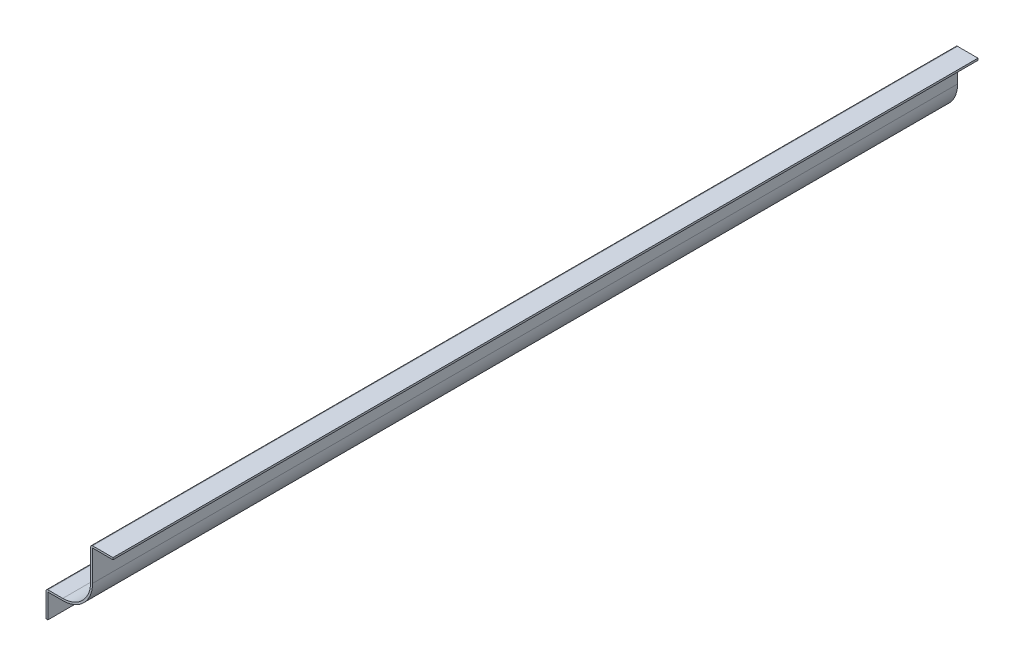
ISO-10303-21;
HEADER;
FILE_DESCRIPTION(('STEP AP214'),'2;1');
FILE_NAME('part.step','',(''),(''),'','','');
FILE_SCHEMA(('AUTOMOTIVE_DESIGN { 1 0 10303 214 1 1 1 1 }'));
ENDSEC;
DATA;
#1=APPLICATION_CONTEXT('core data for automotive mechanical design processes');
#2=APPLICATION_PROTOCOL_DEFINITION('international standard','automotive_design',2000,#1);
#3=PRODUCT_CONTEXT('',#1,'mechanical');
#4=PRODUCT('Part','Part','',(#3));
#5=PRODUCT_RELATED_PRODUCT_CATEGORY('part','',(#4));
#6=PRODUCT_DEFINITION_FORMATION('','',#4);
#7=PRODUCT_DEFINITION_CONTEXT('part definition',#1,'design');
#8=PRODUCT_DEFINITION('design','',#6,#7);
#9=PRODUCT_DEFINITION_SHAPE('','',#8);
#10=(LENGTH_UNIT() NAMED_UNIT(*) SI_UNIT(.MILLI.,.METRE.));
#11=(NAMED_UNIT(*) PLANE_ANGLE_UNIT() SI_UNIT($,.RADIAN.));
#12=(NAMED_UNIT(*) SI_UNIT($,.STERADIAN.) SOLID_ANGLE_UNIT());
#13=UNCERTAINTY_MEASURE_WITH_UNIT(LENGTH_MEASURE(1.E-05),#10,'distance_accuracy_value','');
#14=(GEOMETRIC_REPRESENTATION_CONTEXT(3) GLOBAL_UNCERTAINTY_ASSIGNED_CONTEXT((#13)) GLOBAL_UNIT_ASSIGNED_CONTEXT((#10,
#11,#12)) REPRESENTATION_CONTEXT('',''));
#15=CARTESIAN_POINT('',(0.,0.,0.));
#16=DIRECTION('',(0.,0.,1.));
#17=DIRECTION('',(1.,0.,0.));
#18=AXIS2_PLACEMENT_3D('',#15,#16,#17);
#19=CARTESIAN_POINT('',(38.1,72.16775,-738.1875));
#20=DIRECTION('',(0.,-1.,0.));
#21=DIRECTION('',(1.,0.,0.));
#22=AXIS2_PLACEMENT_3D('',#19,#20,#21);
#23=PLANE('',#22);
#24=DIRECTION('',(1.,0.,0.));
#25=VECTOR('',#24,1.);
#26=CARTESIAN_POINT('',(38.1,72.16775,0.));
#27=LINE('',#26,#25);
#28=CARTESIAN_POINT('',(39.751,72.16775,0.));
#29=VERTEX_POINT('',#28);
#30=CARTESIAN_POINT('',(57.15,72.16775,0.));
#31=VERTEX_POINT('',#30);
#32=EDGE_CURVE('E206',#29,#31,#27,.T.);
#33=ORIENTED_EDGE('',*,*,#32,.F.);
#34=DIRECTION('',(0.,0.,1.));
#35=VECTOR('',#34,1.);
#36=CARTESIAN_POINT('',(39.751,72.16775,-738.1875));
#37=LINE('',#36,#35);
#38=CARTESIAN_POINT('',(39.751,72.16775,-738.1875));
#39=VERTEX_POINT('',#38);
#40=EDGE_CURVE('E177',#39,#29,#37,.T.);
#41=ORIENTED_EDGE('',*,*,#40,.F.);
#42=DIRECTION('',(1.,0.,0.));
#43=VECTOR('',#42,1.);
#44=CARTESIAN_POINT('',(38.1,72.16775,-738.1875));
#45=LINE('',#44,#43);
#46=CARTESIAN_POINT('',(57.15,72.16775,-738.1875));
#47=VERTEX_POINT('',#46);
#48=EDGE_CURVE('E157',#39,#47,#45,.T.);
#49=ORIENTED_EDGE('',*,*,#48,.T.);
#50=DIRECTION('',(0.,0.,1.));
#51=VECTOR('',#50,1.);
#52=CARTESIAN_POINT('',(57.15,72.16775,-738.1875));
#53=LINE('',#52,#51);
#54=EDGE_CURVE('E166',#47,#31,#53,.T.);
#55=ORIENTED_EDGE('',*,*,#54,.T.);
#56=EDGE_LOOP('',(#33,#41,#49,#55));
#57=FACE_BOUND('',#56,.T.);
#58=ADVANCED_FACE('F41',(#57),#23,.T.);
#59=CARTESIAN_POINT('',(39.751,46.0375,-738.1875));
#60=DIRECTION('',(1.,0.,0.));
#61=DIRECTION('',(0.,1.,0.));
#62=AXIS2_PLACEMENT_3D('',#59,#60,#61);
#63=PLANE('',#62);
#64=DIRECTION('',(0.,1.,0.));
#65=VECTOR('',#64,1.);
#66=CARTESIAN_POINT('',(39.751,46.0375,0.));
#67=LINE('',#66,#65);
#68=CARTESIAN_POINT('',(39.751,46.0375,0.));
#69=VERTEX_POINT('',#68);
#70=EDGE_CURVE('E178',#69,#29,#67,.T.);
#71=ORIENTED_EDGE('',*,*,#70,.F.);
#72=DIRECTION('',(0.,0.,1.));
#73=VECTOR('',#72,1.);
#74=CARTESIAN_POINT('',(39.751,46.0375,-738.1875));
#75=LINE('',#74,#73);
#76=CARTESIAN_POINT('',(39.751,46.0375,-738.1875));
#77=VERTEX_POINT('',#76);
#78=EDGE_CURVE('E241',#77,#69,#75,.T.);
#79=ORIENTED_EDGE('',*,*,#78,.F.);
#80=DIRECTION('',(0.,1.,0.));
#81=VECTOR('',#80,1.);
#82=CARTESIAN_POINT('',(39.751,46.0375,-738.1875));
#83=LINE('',#82,#81);
#84=EDGE_CURVE('E175',#77,#39,#83,.T.);
#85=ORIENTED_EDGE('',*,*,#84,.T.);
#86=ORIENTED_EDGE('',*,*,#40,.T.);
#87=EDGE_LOOP('',(#71,#79,#85,#86));
#88=FACE_BOUND('',#87,.T.);
#89=ADVANCED_FACE('F310',(#88),#63,.T.);
#90=CARTESIAN_POINT('',(14.2875,46.0375,-738.1875));
#91=DIRECTION('',(0.,0.,1.));
#92=DIRECTION('',(1.,0.,0.));
#93=AXIS2_PLACEMENT_3D('',#90,#91,#92);
#94=CYLINDRICAL_SURFACE('',#93,25.4635);
#95=CARTESIAN_POINT('',(14.2875,46.0375,0.));
#96=DIRECTION('',(0.,0.,1.));
#97=DIRECTION('',(1.,0.,0.));
#98=AXIS2_PLACEMENT_3D('',#95,#96,#97);
#99=CIRCLE('',#98,25.4635);
#100=CARTESIAN_POINT('',(14.2875,20.574,0.));
#101=VERTEX_POINT('',#100);
#102=EDGE_CURVE('E182',#101,#69,#99,.T.);
#103=ORIENTED_EDGE('',*,*,#102,.F.);
#104=DIRECTION('',(0.,0.,1.));
#105=VECTOR('',#104,1.);
#106=CARTESIAN_POINT('',(14.2875,20.574,-738.1875));
#107=LINE('',#106,#105);
#108=CARTESIAN_POINT('',(14.2875,20.574,-738.1875));
#109=VERTEX_POINT('',#108);
#110=EDGE_CURVE('E244',#109,#101,#107,.T.);
#111=ORIENTED_EDGE('',*,*,#110,.F.);
#112=CARTESIAN_POINT('',(14.2875,46.0375,-738.1875));
#113=DIRECTION('',(0.,0.,1.));
#114=DIRECTION('',(1.,0.,0.));
#115=AXIS2_PLACEMENT_3D('',#112,#113,#114);
#116=CIRCLE('',#115,25.4635);
#117=EDGE_CURVE('E202',#109,#77,#116,.T.);
#118=ORIENTED_EDGE('',*,*,#117,.T.);
#119=ORIENTED_EDGE('',*,*,#78,.T.);
#120=EDGE_LOOP('',(#103,#111,#118,#119));
#121=FACE_BOUND('',#120,.T.);
#122=ADVANCED_FACE('F340',(#121),#94,.T.);
#123=CARTESIAN_POINT('',(0.,20.574,-738.1875));
#124=DIRECTION('',(0.,-1.,0.));
#125=DIRECTION('',(0.,0.,-1.));
#126=AXIS2_PLACEMENT_3D('',#123,#124,#125);
#127=PLANE('',#126);
#128=DIRECTION('',(1.,0.,0.));
#129=VECTOR('',#128,1.);
#130=CARTESIAN_POINT('',(0.,20.574,0.));
#131=LINE('',#130,#129);
#132=CARTESIAN_POINT('',(1.651,20.574,0.));
#133=VERTEX_POINT('',#132);
#134=EDGE_CURVE('E231',#133,#101,#131,.T.);
#135=ORIENTED_EDGE('',*,*,#134,.F.);
#136=DIRECTION('',(0.,0.,1.));
#137=VECTOR('',#136,1.);
#138=CARTESIAN_POINT('',(1.651,20.574,-738.1875));
#139=LINE('',#138,#137);
#140=CARTESIAN_POINT('',(1.651,20.574,-738.1875));
#141=VERTEX_POINT('',#140);
#142=EDGE_CURVE('E247',#141,#133,#139,.T.);
#143=ORIENTED_EDGE('',*,*,#142,.F.);
#144=DIRECTION('',(1.,0.,0.));
#145=VECTOR('',#144,1.);
#146=CARTESIAN_POINT('',(0.,20.574,-738.1875));
#147=LINE('',#146,#145);
#148=EDGE_CURVE('E199',#141,#109,#147,.T.);
#149=ORIENTED_EDGE('',*,*,#148,.T.);
#150=ORIENTED_EDGE('',*,*,#110,.T.);
#151=EDGE_LOOP('',(#135,#143,#149,#150));
#152=FACE_BOUND('',#151,.T.);
#153=ADVANCED_FACE('F317',(#152),#127,.T.);
#154=CARTESIAN_POINT('',(1.651,0.,-738.1875));
#155=DIRECTION('',(1.,0.,0.));
#156=DIRECTION('',(0.,0.,-1.));
#157=AXIS2_PLACEMENT_3D('',#154,#155,#156);
#158=PLANE('',#157);
#159=DIRECTION('',(0.,1.,0.));
#160=VECTOR('',#159,1.);
#161=CARTESIAN_POINT('',(1.651,0.,0.));
#162=LINE('',#161,#160);
#163=CARTESIAN_POINT('',(1.651,0.,0.));
#164=VERTEX_POINT('',#163);
#165=EDGE_CURVE('E227',#164,#133,#162,.T.);
#166=ORIENTED_EDGE('',*,*,#165,.F.);
#167=DIRECTION('',(0.,0.,1.));
#168=VECTOR('',#167,1.);
#169=CARTESIAN_POINT('',(1.651,0.,-738.1875));
#170=LINE('',#169,#168);
#171=CARTESIAN_POINT('',(1.651,0.,-738.1875));
#172=VERTEX_POINT('',#171);
#173=EDGE_CURVE('E250',#172,#164,#170,.T.);
#174=ORIENTED_EDGE('',*,*,#173,.F.);
#175=DIRECTION('',(0.,1.,0.));
#176=VECTOR('',#175,1.);
#177=CARTESIAN_POINT('',(1.651,0.,-738.1875));
#178=LINE('',#177,#176);
#179=EDGE_CURVE('E196',#172,#141,#178,.T.);
#180=ORIENTED_EDGE('',*,*,#179,.T.);
#181=ORIENTED_EDGE('',*,*,#142,.T.);
#182=EDGE_LOOP('',(#166,#174,#180,#181));
#183=FACE_BOUND('',#182,.T.);
#184=ADVANCED_FACE('F320',(#183),#158,.T.);
#185=CARTESIAN_POINT('',(1.651,0.,-738.1875));
#186=DIRECTION('',(0.,1.,0.));
#187=DIRECTION('',(0.,0.,1.));
#188=AXIS2_PLACEMENT_3D('',#185,#186,#187);
#189=PLANE('',#188);
#190=DIRECTION('',(-1.,0.,0.));
#191=VECTOR('',#190,1.);
#192=CARTESIAN_POINT('',(1.651,0.,0.));
#193=LINE('',#192,#191);
#194=CARTESIAN_POINT('',(0.,0.,0.));
#195=VERTEX_POINT('',#194);
#196=EDGE_CURVE('E224',#164,#195,#193,.T.);
#197=ORIENTED_EDGE('',*,*,#196,.T.);
#198=DIRECTION('',(0.,0.,1.));
#199=VECTOR('',#198,1.);
#200=CARTESIAN_POINT('',(0.,0.,-738.1875));
#201=LINE('',#200,#199);
#202=CARTESIAN_POINT('',(0.,0.,-738.1875));
#203=VERTEX_POINT('',#202);
#204=EDGE_CURVE('E253',#203,#195,#201,.T.);
#205=ORIENTED_EDGE('',*,*,#204,.F.);
#206=DIRECTION('',(-1.,0.,0.));
#207=VECTOR('',#206,1.);
#208=CARTESIAN_POINT('',(1.651,0.,-738.1875));
#209=LINE('',#208,#207);
#210=EDGE_CURVE('E194',#172,#203,#209,.T.);
#211=ORIENTED_EDGE('',*,*,#210,.F.);
#212=ORIENTED_EDGE('',*,*,#173,.T.);
#213=EDGE_LOOP('',(#197,#205,#211,#212));
#214=FACE_BOUND('',#213,.T.);
#215=ADVANCED_FACE('F324',(#214),#189,.F.);
#216=CARTESIAN_POINT('',(0.,0.,-738.1875));
#217=DIRECTION('',(1.,0.,0.));
#218=DIRECTION('',(0.,0.,-1.));
#219=AXIS2_PLACEMENT_3D('',#216,#217,#218);
#220=PLANE('',#219);
#221=DIRECTION('',(0.,1.,0.));
#222=VECTOR('',#221,1.);
#223=CARTESIAN_POINT('',(0.,0.,0.));
#224=LINE('',#223,#222);
#225=CARTESIAN_POINT('',(0.,20.574,0.));
#226=VERTEX_POINT('',#225);
#227=EDGE_CURVE('E221',#195,#226,#224,.T.);
#228=ORIENTED_EDGE('',*,*,#227,.T.);
#229=DIRECTION('',(0.,0.,1.));
#230=VECTOR('',#229,1.);
#231=CARTESIAN_POINT('',(0.,20.574,-738.1875));
#232=LINE('',#231,#230);
#233=CARTESIAN_POINT('',(0.,20.574,-738.1875));
#234=VERTEX_POINT('',#233);
#235=EDGE_CURVE('E11',#226,#234,#232,.F.);
#236=ORIENTED_EDGE('',*,*,#235,.T.);
#237=DIRECTION('',(0.,1.,0.));
#238=VECTOR('',#237,1.);
#239=CARTESIAN_POINT('',(0.,0.,-738.1875));
#240=LINE('',#239,#238);
#241=EDGE_CURVE('E192',#203,#234,#240,.T.);
#242=ORIENTED_EDGE('',*,*,#241,.F.);
#243=ORIENTED_EDGE('',*,*,#204,.T.);
#244=EDGE_LOOP('',(#228,#236,#242,#243));
#245=FACE_BOUND('',#244,.T.);
#246=ADVANCED_FACE('F326',(#245),#220,.F.);
#247=CARTESIAN_POINT('',(0.,22.225,-738.1875));
#248=DIRECTION('',(0.,-1.,0.));
#249=DIRECTION('',(0.,0.,-1.));
#250=AXIS2_PLACEMENT_3D('',#247,#248,#249);
#251=PLANE('',#250);
#252=DIRECTION('',(1.,0.,0.));
#253=VECTOR('',#252,1.);
#254=CARTESIAN_POINT('',(0.,22.225,-738.1875));
#255=LINE('',#254,#253);
#256=CARTESIAN_POINT('',(1.651,22.225,-738.1875));
#257=VERTEX_POINT('',#256);
#258=CARTESIAN_POINT('',(14.2875,22.225,-738.1875));
#259=VERTEX_POINT('',#258);
#260=EDGE_CURVE('E190',#257,#259,#255,.T.);
#261=ORIENTED_EDGE('',*,*,#260,.F.);
#262=DIRECTION('',(0.,0.,1.));
#263=VECTOR('',#262,1.);
#264=CARTESIAN_POINT('',(1.651,22.225,-738.1875));
#265=LINE('',#264,#263);
#266=CARTESIAN_POINT('',(1.651,22.225,0.));
#267=VERTEX_POINT('',#266);
#268=EDGE_CURVE('E50',#257,#267,#265,.T.);
#269=ORIENTED_EDGE('',*,*,#268,.T.);
#270=DIRECTION('',(1.,0.,0.));
#271=VECTOR('',#270,1.);
#272=CARTESIAN_POINT('',(0.,22.225,0.));
#273=LINE('',#272,#271);
#274=CARTESIAN_POINT('',(14.2875,22.225,0.));
#275=VERTEX_POINT('',#274);
#276=EDGE_CURVE('E218',#267,#275,#273,.T.);
#277=ORIENTED_EDGE('',*,*,#276,.T.);
#278=DIRECTION('',(0.,0.,1.));
#279=VECTOR('',#278,1.);
#280=CARTESIAN_POINT('',(14.2875,22.225,-738.1875));
#281=LINE('',#280,#279);
#282=EDGE_CURVE('E257',#259,#275,#281,.T.);
#283=ORIENTED_EDGE('',*,*,#282,.F.);
#284=EDGE_LOOP('',(#261,#269,#277,#283));
#285=FACE_BOUND('',#284,.T.);
#286=ADVANCED_FACE('F284',(#285),#251,.F.);
#287=CARTESIAN_POINT('',(14.2875,46.0375,-738.1875));
#288=DIRECTION('',(0.,0.,1.));
#289=DIRECTION('',(1.,0.,0.));
#290=AXIS2_PLACEMENT_3D('',#287,#288,#289);
#291=CYLINDRICAL_SURFACE('',#290,23.8125);
#292=CARTESIAN_POINT('',(14.2875,46.0375,0.));
#293=DIRECTION('',(0.,0.,1.));
#294=DIRECTION('',(1.,0.,0.));
#295=AXIS2_PLACEMENT_3D('',#292,#293,#294);
#296=CIRCLE('',#295,23.8125);
#297=CARTESIAN_POINT('',(38.1,46.0375,0.));
#298=VERTEX_POINT('',#297);
#299=EDGE_CURVE('E215',#275,#298,#296,.T.);
#300=ORIENTED_EDGE('',*,*,#299,.T.);
#301=DIRECTION('',(0.,0.,1.));
#302=VECTOR('',#301,1.);
#303=CARTESIAN_POINT('',(38.1,46.0375,-738.1875));
#304=LINE('',#303,#302);
#305=CARTESIAN_POINT('',(38.1,46.0375,-738.1875));
#306=VERTEX_POINT('',#305);
#307=EDGE_CURVE('E261',#306,#298,#304,.T.);
#308=ORIENTED_EDGE('',*,*,#307,.F.);
#309=CARTESIAN_POINT('',(14.2875,46.0375,-738.1875));
#310=DIRECTION('',(0.,0.,1.));
#311=DIRECTION('',(1.,0.,0.));
#312=AXIS2_PLACEMENT_3D('',#309,#310,#311);
#313=CIRCLE('',#312,23.8125);
#314=EDGE_CURVE('E188',#259,#306,#313,.T.);
#315=ORIENTED_EDGE('',*,*,#314,.F.);
#316=ORIENTED_EDGE('',*,*,#282,.T.);
#317=EDGE_LOOP('',(#300,#308,#315,#316));
#318=FACE_BOUND('',#317,.T.);
#319=ADVANCED_FACE('F295',(#318),#291,.F.);
#320=CARTESIAN_POINT('',(38.1,46.0375,-738.1875));
#321=DIRECTION('',(1.,0.,0.));
#322=DIRECTION('',(0.,1.,0.));
#323=AXIS2_PLACEMENT_3D('',#320,#321,#322);
#324=PLANE('',#323);
#325=DIRECTION('',(0.,1.,0.));
#326=VECTOR('',#325,1.);
#327=CARTESIAN_POINT('',(38.1,46.0375,0.));
#328=LINE('',#327,#326);
#329=CARTESIAN_POINT('',(38.1,72.16775,0.));
#330=VERTEX_POINT('',#329);
#331=EDGE_CURVE('E211',#298,#330,#328,.T.);
#332=ORIENTED_EDGE('',*,*,#331,.T.);
#333=DIRECTION('',(0.,0.,1.));
#334=VECTOR('',#333,1.);
#335=CARTESIAN_POINT('',(38.1,72.16775,-738.1875));
#336=LINE('',#335,#334);
#337=CARTESIAN_POINT('',(38.1,72.16775,-738.1875));
#338=VERTEX_POINT('',#337);
#339=EDGE_CURVE('E274',#330,#338,#336,.F.);
#340=ORIENTED_EDGE('',*,*,#339,.T.);
#341=DIRECTION('',(0.,1.,0.));
#342=VECTOR('',#341,1.);
#343=CARTESIAN_POINT('',(38.1,46.0375,-738.1875));
#344=LINE('',#343,#342);
#345=EDGE_CURVE('E186',#306,#338,#344,.T.);
#346=ORIENTED_EDGE('',*,*,#345,.F.);
#347=ORIENTED_EDGE('',*,*,#307,.T.);
#348=EDGE_LOOP('',(#332,#340,#346,#347));
#349=FACE_BOUND('',#348,.T.);
#350=ADVANCED_FACE('F299',(#349),#324,.F.);
#351=CARTESIAN_POINT('',(38.1,73.81875,-738.1875));
#352=DIRECTION('',(0.,-1.,0.));
#353=DIRECTION('',(1.,0.,0.));
#354=AXIS2_PLACEMENT_3D('',#351,#352,#353);
#355=PLANE('',#354);
#356=DIRECTION('',(1.,0.,0.));
#357=VECTOR('',#356,1.);
#358=CARTESIAN_POINT('',(38.1,73.81875,-738.1875));
#359=LINE('',#358,#357);
#360=CARTESIAN_POINT('',(39.751,73.81875,-738.1875));
#361=VERTEX_POINT('',#360);
#362=CARTESIAN_POINT('',(57.15,73.81875,-738.1875));
#363=VERTEX_POINT('',#362);
#364=EDGE_CURVE('E160',#361,#363,#359,.T.);
#365=ORIENTED_EDGE('',*,*,#364,.F.);
#366=DIRECTION('',(0.,0.,1.));
#367=VECTOR('',#366,1.);
#368=CARTESIAN_POINT('',(39.751,73.81875,-738.1875));
#369=LINE('',#368,#367);
#370=CARTESIAN_POINT('',(39.751,73.81875,0.));
#371=VERTEX_POINT('',#370);
#372=EDGE_CURVE('E240',#361,#371,#369,.T.);
#373=ORIENTED_EDGE('',*,*,#372,.T.);
#374=DIRECTION('',(1.,0.,0.));
#375=VECTOR('',#374,1.);
#376=CARTESIAN_POINT('',(38.1,73.81875,0.));
#377=LINE('',#376,#375);
#378=CARTESIAN_POINT('',(57.15,73.81875,0.));
#379=VERTEX_POINT('',#378);
#380=EDGE_CURVE('E209',#371,#379,#377,.T.);
#381=ORIENTED_EDGE('',*,*,#380,.T.);
#382=DIRECTION('',(0.,0.,1.));
#383=VECTOR('',#382,1.);
#384=CARTESIAN_POINT('',(57.15,73.81875,-738.1875));
#385=LINE('',#384,#383);
#386=EDGE_CURVE('E174',#363,#379,#385,.T.);
#387=ORIENTED_EDGE('',*,*,#386,.F.);
#388=EDGE_LOOP('',(#365,#373,#381,#387));
#389=FACE_BOUND('',#388,.T.);
#390=ADVANCED_FACE('F306',(#389),#355,.F.);
#391=CARTESIAN_POINT('',(57.15,73.81875,-738.1875));
#392=DIRECTION('',(-1.,0.,0.));
#393=DIRECTION('',(0.,0.,1.));
#394=AXIS2_PLACEMENT_3D('',#391,#392,#393);
#395=PLANE('',#394);
#396=DIRECTION('',(0.,-1.,0.));
#397=VECTOR('',#396,1.);
#398=CARTESIAN_POINT('',(57.15,73.81875,0.));
#399=LINE('',#398,#397);
#400=EDGE_CURVE('E169',#379,#31,#399,.T.);
#401=ORIENTED_EDGE('',*,*,#400,.T.);
#402=ORIENTED_EDGE('',*,*,#54,.F.);
#403=DIRECTION('',(0.,-1.,0.));
#404=VECTOR('',#403,1.);
#405=CARTESIAN_POINT('',(57.15,73.81875,-738.1875));
#406=LINE('',#405,#404);
#407=EDGE_CURVE('E151',#363,#47,#406,.T.);
#408=ORIENTED_EDGE('',*,*,#407,.F.);
#409=ORIENTED_EDGE('',*,*,#386,.T.);
#410=EDGE_LOOP('',(#401,#402,#408,#409));
#411=FACE_BOUND('',#410,.T.);
#412=ADVANCED_FACE('F167',(#411),#395,.F.);
#413=CARTESIAN_POINT('',(14.2875,46.0375,-738.1875));
#414=DIRECTION('',(0.,0.,1.));
#415=DIRECTION('',(1.,0.,0.));
#416=AXIS2_PLACEMENT_3D('',#413,#414,#415);
#417=PLANE('',#416);
#418=ORIENTED_EDGE('',*,*,#345,.T.);
#419=CARTESIAN_POINT('',(39.751,72.16775,-738.1875));
#420=DIRECTION('',(0.,0.,1.));
#421=DIRECTION('',(1.,0.,0.));
#422=AXIS2_PLACEMENT_3D('',#419,#420,#421);
#423=CIRCLE('',#422,1.651);
#424=EDGE_CURVE('E278',#338,#361,#423,.F.);
#425=ORIENTED_EDGE('',*,*,#424,.T.);
#426=ORIENTED_EDGE('',*,*,#364,.T.);
#427=ORIENTED_EDGE('',*,*,#407,.T.);
#428=ORIENTED_EDGE('',*,*,#48,.F.);
#429=ORIENTED_EDGE('',*,*,#84,.F.);
#430=ORIENTED_EDGE('',*,*,#117,.F.);
#431=ORIENTED_EDGE('',*,*,#148,.F.);
#432=ORIENTED_EDGE('',*,*,#179,.F.);
#433=ORIENTED_EDGE('',*,*,#210,.T.);
#434=ORIENTED_EDGE('',*,*,#241,.T.);
#435=CARTESIAN_POINT('',(1.651,20.574,-738.1875));
#436=DIRECTION('',(0.,0.,1.));
#437=DIRECTION('',(1.,0.,0.));
#438=AXIS2_PLACEMENT_3D('',#435,#436,#437);
#439=CIRCLE('',#438,1.651);
#440=EDGE_CURVE('E57',#234,#257,#439,.F.);
#441=ORIENTED_EDGE('',*,*,#440,.T.);
#442=ORIENTED_EDGE('',*,*,#260,.T.);
#443=ORIENTED_EDGE('',*,*,#314,.T.);
#444=EDGE_LOOP('',(#418,#425,#426,#427,#428,#429,#430,#431,#432,#433,#434,#441,#442,#443));
#445=FACE_BOUND('',#444,.T.);
#446=ADVANCED_FACE('F154',(#445),#417,.F.);
#447=CARTESIAN_POINT('',(14.2875,46.0375,0.));
#448=DIRECTION('',(0.,0.,1.));
#449=DIRECTION('',(1.,0.,0.));
#450=AXIS2_PLACEMENT_3D('',#447,#448,#449);
#451=PLANE('',#450);
#452=ORIENTED_EDGE('',*,*,#380,.F.);
#453=CARTESIAN_POINT('',(39.751,72.16775,0.));
#454=DIRECTION('',(0.,0.,1.));
#455=DIRECTION('',(1.,0.,0.));
#456=AXIS2_PLACEMENT_3D('',#453,#454,#455);
#457=CIRCLE('',#456,1.651);
#458=EDGE_CURVE('E272',#371,#330,#457,.T.);
#459=ORIENTED_EDGE('',*,*,#458,.T.);
#460=ORIENTED_EDGE('',*,*,#331,.F.);
#461=ORIENTED_EDGE('',*,*,#299,.F.);
#462=ORIENTED_EDGE('',*,*,#276,.F.);
#463=CARTESIAN_POINT('',(1.651,20.574,0.));
#464=DIRECTION('',(0.,0.,1.));
#465=DIRECTION('',(1.,0.,0.));
#466=AXIS2_PLACEMENT_3D('',#463,#464,#465);
#467=CIRCLE('',#466,1.651);
#468=EDGE_CURVE('E269',#267,#226,#467,.T.);
#469=ORIENTED_EDGE('',*,*,#468,.T.);
#470=ORIENTED_EDGE('',*,*,#227,.F.);
#471=ORIENTED_EDGE('',*,*,#196,.F.);
#472=ORIENTED_EDGE('',*,*,#165,.T.);
#473=ORIENTED_EDGE('',*,*,#134,.T.);
#474=ORIENTED_EDGE('',*,*,#102,.T.);
#475=ORIENTED_EDGE('',*,*,#70,.T.);
#476=ORIENTED_EDGE('',*,*,#32,.T.);
#477=ORIENTED_EDGE('',*,*,#400,.F.);
#478=EDGE_LOOP('',(#452,#459,#460,#461,#462,#469,#470,#471,#472,#473,#474,#475,#476,#477));
#479=FACE_BOUND('',#478,.T.);
#480=ADVANCED_FACE('F290',(#479),#451,.T.);
#481=CARTESIAN_POINT('',(39.751,72.16775,-738.1875));
#482=DIRECTION('',(0.,0.,1.));
#483=DIRECTION('',(1.,0.,0.));
#484=AXIS2_PLACEMENT_3D('',#481,#482,#483);
#485=CYLINDRICAL_SURFACE('',#484,1.651);
#486=ORIENTED_EDGE('',*,*,#424,.F.);
#487=ORIENTED_EDGE('',*,*,#339,.F.);
#488=ORIENTED_EDGE('',*,*,#458,.F.);
#489=ORIENTED_EDGE('',*,*,#372,.F.);
#490=EDGE_LOOP('',(#486,#487,#488,#489));
#491=FACE_BOUND('',#490,.T.);
#492=ADVANCED_FACE('F304',(#491),#485,.T.);
#493=CARTESIAN_POINT('',(1.651,20.574,-738.1875));
#494=DIRECTION('',(0.,0.,1.));
#495=DIRECTION('',(1.,0.,0.));
#496=AXIS2_PLACEMENT_3D('',#493,#494,#495);
#497=CYLINDRICAL_SURFACE('',#496,1.651);
#498=ORIENTED_EDGE('',*,*,#440,.F.);
#499=ORIENTED_EDGE('',*,*,#235,.F.);
#500=ORIENTED_EDGE('',*,*,#468,.F.);
#501=ORIENTED_EDGE('',*,*,#268,.F.);
#502=EDGE_LOOP('',(#498,#499,#500,#501));
#503=FACE_BOUND('',#502,.T.);
#504=ADVANCED_FACE('F43',(#503),#497,.T.);
#505=CLOSED_SHELL('',(#58,#89,#122,#153,#184,#215,#246,#286,#319,#350,#390,#412,#446,#480,#492,#504));
#506=MANIFOLD_SOLID_BREP('B2',#505);
#507=ADVANCED_BREP_SHAPE_REPRESENTATION('',(#18,#506),#14);
#508=SHAPE_DEFINITION_REPRESENTATION(#9,#507);
ENDSEC;
END-ISO-10303-21;
